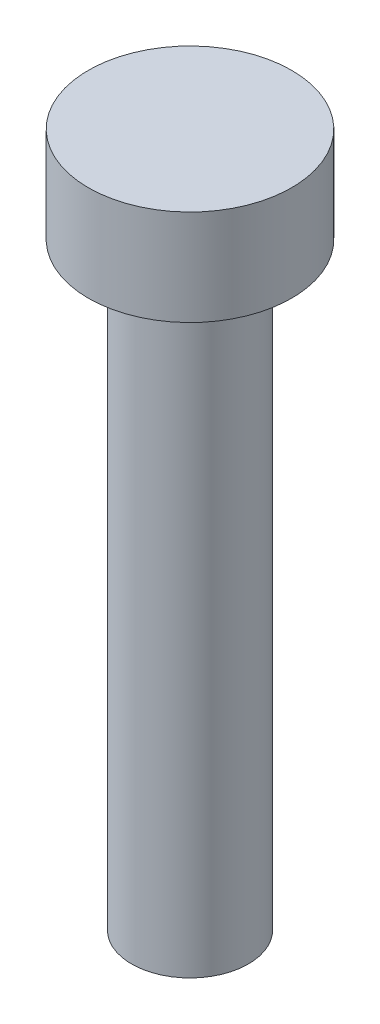
ISO-10303-21;
HEADER;
FILE_DESCRIPTION(('STEP AP214'),'2;1');
FILE_NAME('part.step','',(''),(''),'','','');
FILE_SCHEMA(('AUTOMOTIVE_DESIGN { 1 0 10303 214 1 1 1 1 }'));
ENDSEC;
DATA;
#1=APPLICATION_CONTEXT('core data for automotive mechanical design processes');
#2=APPLICATION_PROTOCOL_DEFINITION('international standard','automotive_design',2000,#1);
#3=PRODUCT_CONTEXT('',#1,'mechanical');
#4=PRODUCT('Part','Part','',(#3));
#5=PRODUCT_RELATED_PRODUCT_CATEGORY('part','',(#4));
#6=PRODUCT_DEFINITION_FORMATION('','',#4);
#7=PRODUCT_DEFINITION_CONTEXT('part definition',#1,'design');
#8=PRODUCT_DEFINITION('design','',#6,#7);
#9=PRODUCT_DEFINITION_SHAPE('','',#8);
#10=(LENGTH_UNIT() NAMED_UNIT(*) SI_UNIT(.MILLI.,.METRE.));
#11=(NAMED_UNIT(*) PLANE_ANGLE_UNIT() SI_UNIT($,.RADIAN.));
#12=(NAMED_UNIT(*) SI_UNIT($,.STERADIAN.) SOLID_ANGLE_UNIT());
#13=UNCERTAINTY_MEASURE_WITH_UNIT(LENGTH_MEASURE(1.E-05),#10,'distance_accuracy_value','');
#14=(GEOMETRIC_REPRESENTATION_CONTEXT(3) GLOBAL_UNCERTAINTY_ASSIGNED_CONTEXT((#13)) GLOBAL_UNIT_ASSIGNED_CONTEXT((#10,
#11,#12)) REPRESENTATION_CONTEXT('',''));
#15=CARTESIAN_POINT('',(0.,0.,0.));
#16=DIRECTION('',(0.,0.,1.));
#17=DIRECTION('',(1.,0.,0.));
#18=AXIS2_PLACEMENT_3D('',#15,#16,#17);
#19=CARTESIAN_POINT('',(0.,4.,0.));
#20=DIRECTION('',(0.,-1.,0.));
#21=DIRECTION('',(0.,0.,-1.));
#22=AXIS2_PLACEMENT_3D('',#19,#20,#21);
#23=CYLINDRICAL_SURFACE('',#22,4.25);
#24=CARTESIAN_POINT('',(0.,4.,0.));
#25=DIRECTION('',(0.,1.,0.));
#26=DIRECTION('',(0.,0.,1.));
#27=AXIS2_PLACEMENT_3D('',#24,#25,#26);
#28=CIRCLE('',#27,4.25);
#29=CARTESIAN_POINT('',(0.,4.,4.25));
#30=VERTEX_POINT('',#29);
#31=EDGE_CURVE('E38',#30,#30,#28,.T.);
#32=ORIENTED_EDGE('',*,*,#31,.F.);
#33=EDGE_LOOP('',(#32));
#34=FACE_BOUND('',#33,.T.);
#35=CARTESIAN_POINT('',(0.,0.,0.));
#36=DIRECTION('',(0.,1.,0.));
#37=DIRECTION('',(0.,0.,1.));
#38=AXIS2_PLACEMENT_3D('',#35,#36,#37);
#39=CIRCLE('',#38,4.25);
#40=CARTESIAN_POINT('',(0.,0.,4.25));
#41=VERTEX_POINT('',#40);
#42=EDGE_CURVE('E34',#41,#41,#39,.T.);
#43=ORIENTED_EDGE('',*,*,#42,.T.);
#44=EDGE_LOOP('',(#43));
#45=FACE_BOUND('',#44,.T.);
#46=ADVANCED_FACE('F31',(#34,#45),#23,.T.);
#47=CARTESIAN_POINT('',(0.,4.,0.));
#48=DIRECTION('',(0.,1.,0.));
#49=DIRECTION('',(0.,0.,1.));
#50=AXIS2_PLACEMENT_3D('',#47,#48,#49);
#51=PLANE('',#50);
#52=ORIENTED_EDGE('',*,*,#31,.T.);
#53=EDGE_LOOP('',(#52));
#54=FACE_BOUND('',#53,.T.);
#55=ADVANCED_FACE('F55',(#54),#51,.T.);
#56=CARTESIAN_POINT('',(0.,0.,0.));
#57=DIRECTION('',(0.,1.,0.));
#58=DIRECTION('',(0.,0.,1.));
#59=AXIS2_PLACEMENT_3D('',#56,#57,#58);
#60=PLANE('',#59);
#61=CARTESIAN_POINT('',(0.,0.,0.));
#62=DIRECTION('',(0.,-1.,0.));
#63=DIRECTION('',(0.,0.,-1.));
#64=AXIS2_PLACEMENT_3D('',#61,#62,#63);
#65=CIRCLE('',#64,2.44);
#66=CARTESIAN_POINT('',(0.,0.,-2.44));
#67=VERTEX_POINT('',#66);
#68=EDGE_CURVE('E10',#67,#67,#65,.T.);
#69=ORIENTED_EDGE('',*,*,#68,.F.);
#70=EDGE_LOOP('',(#69));
#71=FACE_BOUND('',#70,.T.);
#72=ORIENTED_EDGE('',*,*,#42,.F.);
#73=EDGE_LOOP('',(#72));
#74=FACE_BOUND('',#73,.T.);
#75=ADVANCED_FACE('F52',(#71,#74),#60,.F.);
#76=CARTESIAN_POINT('',(0.,-25.,0.));
#77=DIRECTION('',(0.,1.,0.));
#78=DIRECTION('',(0.,0.,1.));
#79=AXIS2_PLACEMENT_3D('',#76,#77,#78);
#80=CYLINDRICAL_SURFACE('',#79,2.44);
#81=CARTESIAN_POINT('',(0.,-25.,0.));
#82=DIRECTION('',(0.,-1.,0.));
#83=DIRECTION('',(0.,0.,-1.));
#84=AXIS2_PLACEMENT_3D('',#81,#82,#83);
#85=CIRCLE('',#84,2.44);
#86=CARTESIAN_POINT('',(0.,-25.,-2.44));
#87=VERTEX_POINT('',#86);
#88=EDGE_CURVE('E44',#87,#87,#85,.T.);
#89=ORIENTED_EDGE('',*,*,#88,.F.);
#90=EDGE_LOOP('',(#89));
#91=FACE_BOUND('',#90,.T.);
#92=ORIENTED_EDGE('',*,*,#68,.T.);
#93=EDGE_LOOP('',(#92));
#94=FACE_BOUND('',#93,.T.);
#95=ADVANCED_FACE('F54',(#91,#94),#80,.T.);
#96=CARTESIAN_POINT('',(0.,-25.,0.));
#97=DIRECTION('',(0.,-1.,0.));
#98=DIRECTION('',(0.,0.,-1.));
#99=AXIS2_PLACEMENT_3D('',#96,#97,#98);
#100=PLANE('',#99);
#101=ORIENTED_EDGE('',*,*,#88,.T.);
#102=EDGE_LOOP('',(#101));
#103=FACE_BOUND('',#102,.T.);
#104=ADVANCED_FACE('F61',(#103),#100,.T.);
#105=CLOSED_SHELL('',(#46,#55,#75,#95,#104));
#106=MANIFOLD_SOLID_BREP('B2',#105);
#107=ADVANCED_BREP_SHAPE_REPRESENTATION('',(#18,#106),#14);
#108=SHAPE_DEFINITION_REPRESENTATION(#9,#107);
ENDSEC;
END-ISO-10303-21;
